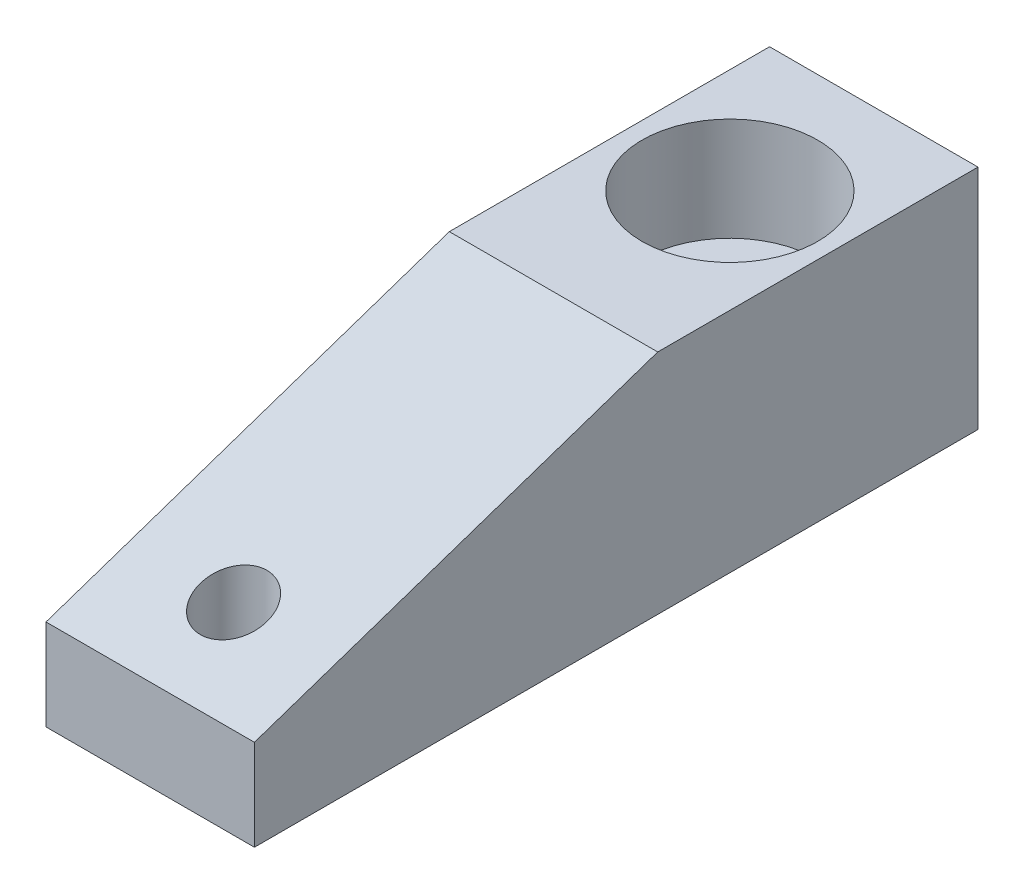
ISO-10303-21;
HEADER;
FILE_DESCRIPTION(('STEP AP214'),'2;1');
FILE_NAME('part.step','',(''),(''),'','','');
FILE_SCHEMA(('AUTOMOTIVE_DESIGN { 1 0 10303 214 1 1 1 1 }'));
ENDSEC;
DATA;
#1=APPLICATION_CONTEXT('core data for automotive mechanical design processes');
#2=APPLICATION_PROTOCOL_DEFINITION('international standard','automotive_design',2000,#1);
#3=PRODUCT_CONTEXT('',#1,'mechanical');
#4=PRODUCT('Part','Part','',(#3));
#5=PRODUCT_RELATED_PRODUCT_CATEGORY('part','',(#4));
#6=PRODUCT_DEFINITION_FORMATION('','',#4);
#7=PRODUCT_DEFINITION_CONTEXT('part definition',#1,'design');
#8=PRODUCT_DEFINITION('design','',#6,#7);
#9=PRODUCT_DEFINITION_SHAPE('','',#8);
#10=(LENGTH_UNIT() NAMED_UNIT(*) SI_UNIT(.MILLI.,.METRE.));
#11=(NAMED_UNIT(*) PLANE_ANGLE_UNIT() SI_UNIT($,.RADIAN.));
#12=(NAMED_UNIT(*) SI_UNIT($,.STERADIAN.) SOLID_ANGLE_UNIT());
#13=UNCERTAINTY_MEASURE_WITH_UNIT(LENGTH_MEASURE(1.E-05),#10,'distance_accuracy_value','');
#14=(GEOMETRIC_REPRESENTATION_CONTEXT(3) GLOBAL_UNCERTAINTY_ASSIGNED_CONTEXT((#13)) GLOBAL_UNIT_ASSIGNED_CONTEXT((#10,
#11,#12)) REPRESENTATION_CONTEXT('',''));
#15=CARTESIAN_POINT('',(0.,0.,0.));
#16=DIRECTION('',(0.,0.,1.));
#17=DIRECTION('',(1.,0.,0.));
#18=AXIS2_PLACEMENT_3D('',#15,#16,#17);
#19=CARTESIAN_POINT('',(0.,17.4498,0.));
#20=DIRECTION('',(1.,0.,0.));
#21=DIRECTION('',(0.,0.,-1.));
#22=AXIS2_PLACEMENT_3D('',#19,#20,#21);
#23=PLANE('',#22);
#24=DIRECTION('',(0.,-1.,0.));
#25=VECTOR('',#24,1.);
#26=CARTESIAN_POINT('',(0.,17.4498,55.5498));
#27=LINE('',#26,#25);
#28=CARTESIAN_POINT('',(0.,6.97992,55.5498));
#29=VERTEX_POINT('',#28);
#30=CARTESIAN_POINT('',(0.,0.,55.5498));
#31=VERTEX_POINT('',#30);
#32=EDGE_CURVE('E115',#29,#31,#27,.T.);
#33=ORIENTED_EDGE('',*,*,#32,.F.);
#34=DIRECTION('',(0.,0.320327990613206,-0.947306697131243));
#35=VECTOR('',#34,1.);
#36=CARTESIAN_POINT('',(0.,6.97992,55.5498));
#37=LINE('',#36,#35);
#38=CARTESIAN_POINT('',(0.,17.4498,24.5872));
#39=VERTEX_POINT('',#38);
#40=EDGE_CURVE('E181',#29,#39,#37,.T.);
#41=ORIENTED_EDGE('',*,*,#40,.T.);
#42=DIRECTION('',(0.,0.,1.));
#43=VECTOR('',#42,1.);
#44=CARTESIAN_POINT('',(0.,17.4498,0.));
#45=LINE('',#44,#43);
#46=CARTESIAN_POINT('',(0.,17.4498,0.));
#47=VERTEX_POINT('',#46);
#48=EDGE_CURVE('E89',#47,#39,#45,.T.);
#49=ORIENTED_EDGE('',*,*,#48,.F.);
#50=DIRECTION('',(0.,-1.,0.));
#51=VECTOR('',#50,1.);
#52=CARTESIAN_POINT('',(0.,17.4498,0.));
#53=LINE('',#52,#51);
#54=CARTESIAN_POINT('',(0.,0.,0.));
#55=VERTEX_POINT('',#54);
#56=EDGE_CURVE('E82',#47,#55,#53,.T.);
#57=ORIENTED_EDGE('',*,*,#56,.T.);
#58=DIRECTION('',(0.,0.,1.));
#59=VECTOR('',#58,1.);
#60=CARTESIAN_POINT('',(0.,0.,0.));
#61=LINE('',#60,#59);
#62=EDGE_CURVE('E95',#55,#31,#61,.T.);
#63=ORIENTED_EDGE('',*,*,#62,.T.);
#64=EDGE_LOOP('',(#33,#41,#49,#57,#63));
#65=FACE_BOUND('',#64,.T.);
#66=ADVANCED_FACE('F35',(#65),#23,.F.);
#67=CARTESIAN_POINT('',(0.,17.4498,55.5498));
#68=DIRECTION('',(0.,0.,-1.));
#69=DIRECTION('',(-1.,0.,0.));
#70=AXIS2_PLACEMENT_3D('',#67,#68,#69);
#71=PLANE('',#70);
#72=DIRECTION('',(0.,-1.,0.));
#73=VECTOR('',#72,1.);
#74=CARTESIAN_POINT('',(16.002,17.4498,55.5498));
#75=LINE('',#74,#73);
#76=CARTESIAN_POINT('',(16.002,6.97992,55.5498));
#77=VERTEX_POINT('',#76);
#78=CARTESIAN_POINT('',(16.002,0.,55.5498));
#79=VERTEX_POINT('',#78);
#80=EDGE_CURVE('E113',#77,#79,#75,.T.);
#81=ORIENTED_EDGE('',*,*,#80,.F.);
#82=DIRECTION('',(1.,0.,0.));
#83=VECTOR('',#82,1.);
#84=CARTESIAN_POINT('',(0.,6.97992,55.5498));
#85=LINE('',#84,#83);
#86=EDGE_CURVE('E185',#29,#77,#85,.T.);
#87=ORIENTED_EDGE('',*,*,#86,.F.);
#88=ORIENTED_EDGE('',*,*,#32,.T.);
#89=DIRECTION('',(1.,0.,0.));
#90=VECTOR('',#89,1.);
#91=CARTESIAN_POINT('',(0.,0.,55.5498));
#92=LINE('',#91,#90);
#93=EDGE_CURVE('E101',#31,#79,#92,.T.);
#94=ORIENTED_EDGE('',*,*,#93,.T.);
#95=EDGE_LOOP('',(#81,#87,#88,#94));
#96=FACE_BOUND('',#95,.T.);
#97=ADVANCED_FACE('F137',(#96),#71,.F.);
#98=CARTESIAN_POINT('',(16.002,17.4498,0.));
#99=DIRECTION('',(-1.,0.,0.));
#100=DIRECTION('',(0.,0.,1.));
#101=AXIS2_PLACEMENT_3D('',#98,#99,#100);
#102=PLANE('',#101);
#103=DIRECTION('',(0.,0.,-1.));
#104=VECTOR('',#103,1.);
#105=CARTESIAN_POINT('',(16.002,17.4498,0.));
#106=LINE('',#105,#104);
#107=CARTESIAN_POINT('',(16.002,17.4498,24.5872));
#108=VERTEX_POINT('',#107);
#109=CARTESIAN_POINT('',(16.002,17.4498,0.));
#110=VERTEX_POINT('',#109);
#111=EDGE_CURVE('E201',#108,#110,#106,.T.);
#112=ORIENTED_EDGE('',*,*,#111,.F.);
#113=DIRECTION('',(0.,0.320327990613206,-0.947306697131243));
#114=VECTOR('',#113,1.);
#115=CARTESIAN_POINT('',(16.002,6.97992,55.5498));
#116=LINE('',#115,#114);
#117=EDGE_CURVE('E51',#77,#108,#116,.T.);
#118=ORIENTED_EDGE('',*,*,#117,.F.);
#119=ORIENTED_EDGE('',*,*,#80,.T.);
#120=DIRECTION('',(0.,0.,-1.));
#121=VECTOR('',#120,1.);
#122=CARTESIAN_POINT('',(16.002,0.,0.));
#123=LINE('',#122,#121);
#124=CARTESIAN_POINT('',(16.002,0.,0.));
#125=VERTEX_POINT('',#124);
#126=EDGE_CURVE('E90',#79,#125,#123,.T.);
#127=ORIENTED_EDGE('',*,*,#126,.T.);
#128=DIRECTION('',(0.,-1.,0.));
#129=VECTOR('',#128,1.);
#130=CARTESIAN_POINT('',(16.002,17.4498,0.));
#131=LINE('',#130,#129);
#132=EDGE_CURVE('E85',#110,#125,#131,.T.);
#133=ORIENTED_EDGE('',*,*,#132,.F.);
#134=EDGE_LOOP('',(#112,#118,#119,#127,#133));
#135=FACE_BOUND('',#134,.T.);
#136=ADVANCED_FACE('F141',(#135),#102,.F.);
#137=CARTESIAN_POINT('',(0.,17.4498,0.));
#138=DIRECTION('',(0.,0.,1.));
#139=DIRECTION('',(1.,0.,0.));
#140=AXIS2_PLACEMENT_3D('',#137,#138,#139);
#141=PLANE('',#140);
#142=DIRECTION('',(-1.,0.,0.));
#143=VECTOR('',#142,1.);
#144=CARTESIAN_POINT('',(0.,0.,0.));
#145=LINE('',#144,#143);
#146=EDGE_CURVE('E79',#125,#55,#145,.T.);
#147=ORIENTED_EDGE('',*,*,#146,.T.);
#148=ORIENTED_EDGE('',*,*,#56,.F.);
#149=DIRECTION('',(-1.,0.,0.));
#150=VECTOR('',#149,1.);
#151=CARTESIAN_POINT('',(0.,17.4498,0.));
#152=LINE('',#151,#150);
#153=EDGE_CURVE('E60',#110,#47,#152,.T.);
#154=ORIENTED_EDGE('',*,*,#153,.F.);
#155=ORIENTED_EDGE('',*,*,#132,.T.);
#156=EDGE_LOOP('',(#147,#148,#154,#155));
#157=FACE_BOUND('',#156,.T.);
#158=ADVANCED_FACE('F81',(#157),#141,.F.);
#159=CARTESIAN_POINT('',(0.,17.4498,55.5498));
#160=DIRECTION('',(0.,1.,0.));
#161=DIRECTION('',(0.,0.,1.));
#162=AXIS2_PLACEMENT_3D('',#159,#160,#161);
#163=PLANE('',#162);
#164=DIRECTION('',(1.,0.,0.));
#165=VECTOR('',#164,1.);
#166=CARTESIAN_POINT('',(0.,17.4498,24.5872));
#167=LINE('',#166,#165);
#168=EDGE_CURVE('E187',#39,#108,#167,.T.);
#169=ORIENTED_EDGE('',*,*,#168,.T.);
#170=ORIENTED_EDGE('',*,*,#111,.T.);
#171=ORIENTED_EDGE('',*,*,#153,.T.);
#172=ORIENTED_EDGE('',*,*,#48,.T.);
#173=EDGE_LOOP('',(#169,#170,#171,#172));
#174=FACE_BOUND('',#173,.T.);
#175=CARTESIAN_POINT('',(8.0518,17.4498,11.0998));
#176=DIRECTION('',(0.,1.,0.));
#177=DIRECTION('',(0.,0.,1.));
#178=AXIS2_PLACEMENT_3D('',#175,#176,#177);
#179=CIRCLE('',#178,6.7437);
#180=CARTESIAN_POINT('',(8.0518,17.4498,17.8435));
#181=VERTEX_POINT('',#180);
#182=EDGE_CURVE('E102',#181,#181,#179,.T.);
#183=ORIENTED_EDGE('',*,*,#182,.F.);
#184=EDGE_LOOP('',(#183));
#185=FACE_BOUND('',#184,.T.);
#186=ADVANCED_FACE('F150',(#174,#185),#163,.T.);
#187=CARTESIAN_POINT('',(0.,0.,55.5498));
#188=DIRECTION('',(0.,1.,0.));
#189=DIRECTION('',(0.,0.,1.));
#190=AXIS2_PLACEMENT_3D('',#187,#188,#189);
#191=PLANE('',#190);
#192=CARTESIAN_POINT('',(8.0518,0.,49.1998));
#193=DIRECTION('',(0.,-1.,0.));
#194=DIRECTION('',(0.,0.,-1.));
#195=AXIS2_PLACEMENT_3D('',#192,#193,#194);
#196=CIRCLE('',#195,2.5527);
#197=CARTESIAN_POINT('',(8.0518,0.,46.6471));
#198=VERTEX_POINT('',#197);
#199=EDGE_CURVE('E178',#198,#198,#196,.T.);
#200=ORIENTED_EDGE('',*,*,#199,.F.);
#201=EDGE_LOOP('',(#200));
#202=FACE_BOUND('',#201,.T.);
#203=CARTESIAN_POINT('',(8.0518,0.,11.0998));
#204=DIRECTION('',(0.,1.,0.));
#205=DIRECTION('',(0.,0.,1.));
#206=AXIS2_PLACEMENT_3D('',#203,#204,#205);
#207=CIRCLE('',#206,6.2484);
#208=CARTESIAN_POINT('',(8.0518,0.,17.3482));
#209=VERTEX_POINT('',#208);
#210=EDGE_CURVE('E189',#209,#209,#207,.T.);
#211=ORIENTED_EDGE('',*,*,#210,.T.);
#212=EDGE_LOOP('',(#211));
#213=FACE_BOUND('',#212,.T.);
#214=ORIENTED_EDGE('',*,*,#62,.F.);
#215=ORIENTED_EDGE('',*,*,#146,.F.);
#216=ORIENTED_EDGE('',*,*,#126,.F.);
#217=ORIENTED_EDGE('',*,*,#93,.F.);
#218=EDGE_LOOP('',(#214,#215,#216,#217));
#219=FACE_BOUND('',#218,.T.);
#220=ADVANCED_FACE('F99',(#202,#213,#219),#191,.F.);
#221=CARTESIAN_POINT('',(8.0518,31.6794444444445,11.0998));
#222=DIRECTION('',(0.,1.,0.));
#223=DIRECTION('',(0.,0.,1.));
#224=AXIS2_PLACEMENT_3D('',#221,#222,#223);
#225=CYLINDRICAL_SURFACE('',#224,6.7437);
#226=CARTESIAN_POINT('',(8.0518,9.525,11.0998));
#227=DIRECTION('',(0.,1.,0.));
#228=DIRECTION('',(0.,0.,1.));
#229=AXIS2_PLACEMENT_3D('',#226,#227,#228);
#230=CIRCLE('',#229,6.7437);
#231=CARTESIAN_POINT('',(8.0518,9.525,17.8435));
#232=VERTEX_POINT('',#231);
#233=EDGE_CURVE('E106',#232,#232,#230,.T.);
#234=ORIENTED_EDGE('',*,*,#233,.F.);
#235=EDGE_LOOP('',(#234));
#236=FACE_BOUND('',#235,.T.);
#237=ORIENTED_EDGE('',*,*,#182,.T.);
#238=EDGE_LOOP('',(#237));
#239=FACE_BOUND('',#238,.T.);
#240=ADVANCED_FACE('F153',(#236,#239),#225,.F.);
#241=CARTESIAN_POINT('',(8.0518,9.525,17.8435));
#242=DIRECTION('',(0.,-1.,0.));
#243=DIRECTION('',(0.,0.,-1.));
#244=AXIS2_PLACEMENT_3D('',#241,#242,#243);
#245=PLANE('',#244);
#246=CARTESIAN_POINT('',(8.0518,9.525,11.0998));
#247=DIRECTION('',(0.,1.,0.));
#248=DIRECTION('',(0.,0.,1.));
#249=AXIS2_PLACEMENT_3D('',#246,#247,#248);
#250=CIRCLE('',#249,4.3688);
#251=CARTESIAN_POINT('',(8.0518,9.525,15.4686));
#252=VERTEX_POINT('',#251);
#253=EDGE_CURVE('E196',#252,#252,#250,.T.);
#254=ORIENTED_EDGE('',*,*,#253,.F.);
#255=EDGE_LOOP('',(#254));
#256=FACE_BOUND('',#255,.T.);
#257=ORIENTED_EDGE('',*,*,#233,.T.);
#258=EDGE_LOOP('',(#257));
#259=FACE_BOUND('',#258,.T.);
#260=ADVANCED_FACE('F159',(#256,#259),#245,.F.);
#261=CARTESIAN_POINT('',(8.0518,31.6794444444445,11.0998));
#262=DIRECTION('',(0.,1.,0.));
#263=DIRECTION('',(0.,0.,1.));
#264=AXIS2_PLACEMENT_3D('',#261,#262,#263);
#265=CYLINDRICAL_SURFACE('',#264,4.3688);
#266=CARTESIAN_POINT('',(8.0518,6.6548,11.0998));
#267=DIRECTION('',(0.,1.,0.));
#268=DIRECTION('',(0.,0.,1.));
#269=AXIS2_PLACEMENT_3D('',#266,#267,#268);
#270=CIRCLE('',#269,4.3688);
#271=CARTESIAN_POINT('',(8.0518,6.6548,15.4686));
#272=VERTEX_POINT('',#271);
#273=EDGE_CURVE('E193',#272,#272,#270,.T.);
#274=ORIENTED_EDGE('',*,*,#273,.F.);
#275=EDGE_LOOP('',(#274));
#276=FACE_BOUND('',#275,.T.);
#277=ORIENTED_EDGE('',*,*,#253,.T.);
#278=EDGE_LOOP('',(#277));
#279=FACE_BOUND('',#278,.T.);
#280=ADVANCED_FACE('F163',(#276,#279),#265,.F.);
#281=CARTESIAN_POINT('',(8.0518,6.6548,15.4686));
#282=DIRECTION('',(0.,1.,0.));
#283=DIRECTION('',(0.,0.,1.));
#284=AXIS2_PLACEMENT_3D('',#281,#282,#283);
#285=PLANE('',#284);
#286=CARTESIAN_POINT('',(8.0518,6.6548,11.0998));
#287=DIRECTION('',(0.,1.,0.));
#288=DIRECTION('',(0.,0.,1.));
#289=AXIS2_PLACEMENT_3D('',#286,#287,#288);
#290=CIRCLE('',#289,5.48296598393149);
#291=CARTESIAN_POINT('',(8.0518,6.6548,16.5827659839315));
#292=VERTEX_POINT('',#291);
#293=EDGE_CURVE('E11',#292,#292,#290,.F.);
#294=ORIENTED_EDGE('',*,*,#293,.T.);
#295=EDGE_LOOP('',(#294));
#296=FACE_BOUND('',#295,.T.);
#297=ORIENTED_EDGE('',*,*,#273,.T.);
#298=EDGE_LOOP('',(#297));
#299=FACE_BOUND('',#298,.T.);
#300=ADVANCED_FACE('F133',(#296,#299),#285,.F.);
#301=CARTESIAN_POINT('',(8.0518,6.6548,11.0998));
#302=DIRECTION('',(0.,-1.,0.));
#303=DIRECTION('',(0.,0.,-1.));
#304=AXIS2_PLACEMENT_3D('',#301,#302,#303);
#305=CONICAL_SURFACE('',#304,5.84137499542256,0.061086523819802);
#306=CARTESIAN_POINT('',(8.0518,6.29705949356278,11.0998));
#307=DIRECTION('',(0.,-1.,0.));
#308=DIRECTION('',(0.,0.,-1.));
#309=AXIS2_PLACEMENT_3D('',#306,#307,#308);
#310=CIRCLE('',#309,5.86325534213022);
#311=CARTESIAN_POINT('',(8.0518,6.29705949356278,5.23654465786978));
#312=VERTEX_POINT('',#311);
#313=EDGE_CURVE('E44',#312,#312,#310,.F.);
#314=ORIENTED_EDGE('',*,*,#313,.T.);
#315=EDGE_LOOP('',(#314));
#316=FACE_BOUND('',#315,.T.);
#317=ORIENTED_EDGE('',*,*,#210,.F.);
#318=EDGE_LOOP('',(#317));
#319=FACE_BOUND('',#318,.T.);
#320=ADVANCED_FACE('F120',(#316,#319),#305,.F.);
#321=CARTESIAN_POINT('',(8.0518,6.2738,11.0998));
#322=DIRECTION('',(0.,1.,0.));
#323=DIRECTION('',(0.,0.,1.));
#324=AXIS2_PLACEMENT_3D('',#321,#322,#323);
#325=TOROIDAL_SURFACE('',#324,5.48296598393149,0.381);
#326=ORIENTED_EDGE('',*,*,#293,.F.);
#327=EDGE_LOOP('',(#326));
#328=FACE_BOUND('',#327,.T.);
#329=ORIENTED_EDGE('',*,*,#313,.F.);
#330=EDGE_LOOP('',(#329));
#331=FACE_BOUND('',#330,.T.);
#332=ADVANCED_FACE('F37',(#328,#331),#325,.F.);
#333=CARTESIAN_POINT('',(0.,6.97992,55.5498));
#334=DIRECTION('',(0.,-0.947306697131243,-0.320327990613206));
#335=DIRECTION('',(0.,0.320327990613206,-0.947306697131244));
#336=AXIS2_PLACEMENT_3D('',#333,#334,#335);
#337=PLANE('',#336);
#338=CARTESIAN_POINT('',(8.0518,9.12714723543888,49.1998));
#339=DIRECTION('',(0.,-0.947306697131243,-0.320327990613206));
#340=DIRECTION('',(0.,-0.320327990613206,0.947306697131244));
#341=AXIS2_PLACEMENT_3D('',#338,#339,#340);
#342=ELLIPSE('',#341,2.6946922340256,2.5527);
#343=CARTESIAN_POINT('',(8.0518,8.26396188679245,51.7525));
#344=VERTEX_POINT('',#343);
#345=EDGE_CURVE('E39',#344,#344,#342,.T.);
#346=ORIENTED_EDGE('',*,*,#345,.T.);
#347=EDGE_LOOP('',(#346));
#348=FACE_BOUND('',#347,.T.);
#349=ORIENTED_EDGE('',*,*,#117,.T.);
#350=ORIENTED_EDGE('',*,*,#168,.F.);
#351=ORIENTED_EDGE('',*,*,#40,.F.);
#352=ORIENTED_EDGE('',*,*,#86,.T.);
#353=EDGE_LOOP('',(#349,#350,#351,#352));
#354=FACE_BOUND('',#353,.T.);
#355=ADVANCED_FACE('F124',(#348,#354),#337,.F.);
#356=CARTESIAN_POINT('',(8.0518,17.4498,49.1998));
#357=DIRECTION('',(0.,-1.,0.));
#358=DIRECTION('',(0.,0.,-1.));
#359=AXIS2_PLACEMENT_3D('',#356,#357,#358);
#360=CYLINDRICAL_SURFACE('',#359,2.5527);
#361=ORIENTED_EDGE('',*,*,#199,.T.);
#362=EDGE_LOOP('',(#361));
#363=FACE_BOUND('',#362,.T.);
#364=ORIENTED_EDGE('',*,*,#345,.F.);
#365=EDGE_LOOP('',(#364));
#366=FACE_BOUND('',#365,.T.);
#367=ADVANCED_FACE('F130',(#363,#366),#360,.F.);
#368=CLOSED_SHELL('',(#66,#97,#136,#158,#186,#220,#240,#260,#280,#300,#320,#332,#355,#367));
#369=MANIFOLD_SOLID_BREP('B2',#368);
#370=ADVANCED_BREP_SHAPE_REPRESENTATION('',(#18,#369),#14);
#371=SHAPE_DEFINITION_REPRESENTATION(#9,#370);
ENDSEC;
END-ISO-10303-21;
